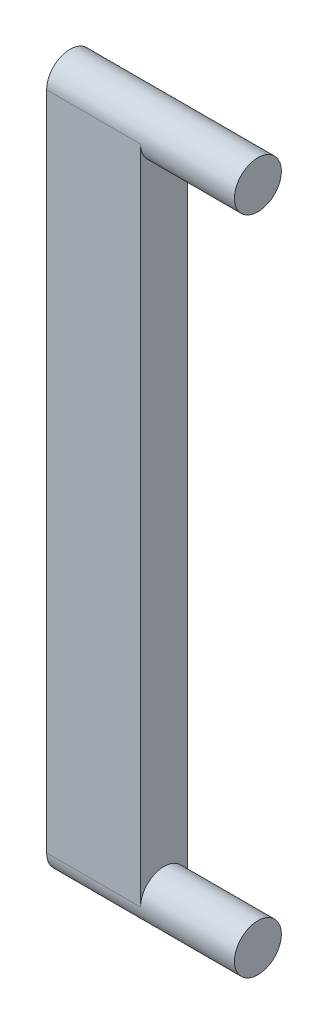
ISO-10303-21;
HEADER;
FILE_DESCRIPTION(('STEP AP214'),'2;1');
FILE_NAME('part.step','',(''),(''),'','','');
FILE_SCHEMA(('AUTOMOTIVE_DESIGN { 1 0 10303 214 1 1 1 1 }'));
ENDSEC;
DATA;
#1=APPLICATION_CONTEXT('core data for automotive mechanical design processes');
#2=APPLICATION_PROTOCOL_DEFINITION('international standard','automotive_design',2000,#1);
#3=PRODUCT_CONTEXT('',#1,'mechanical');
#4=PRODUCT('Part','Part','',(#3));
#5=PRODUCT_RELATED_PRODUCT_CATEGORY('part','',(#4));
#6=PRODUCT_DEFINITION_FORMATION('','',#4);
#7=PRODUCT_DEFINITION_CONTEXT('part definition',#1,'design');
#8=PRODUCT_DEFINITION('design','',#6,#7);
#9=PRODUCT_DEFINITION_SHAPE('','',#8);
#10=(LENGTH_UNIT() NAMED_UNIT(*) SI_UNIT(.MILLI.,.METRE.));
#11=(NAMED_UNIT(*) PLANE_ANGLE_UNIT() SI_UNIT($,.RADIAN.));
#12=(NAMED_UNIT(*) SI_UNIT($,.STERADIAN.) SOLID_ANGLE_UNIT());
#13=UNCERTAINTY_MEASURE_WITH_UNIT(LENGTH_MEASURE(1.E-05),#10,'distance_accuracy_value','');
#14=(GEOMETRIC_REPRESENTATION_CONTEXT(3) GLOBAL_UNCERTAINTY_ASSIGNED_CONTEXT((#13)) GLOBAL_UNIT_ASSIGNED_CONTEXT((#10,
#11,#12)) REPRESENTATION_CONTEXT('',''));
#15=CARTESIAN_POINT('',(0.,0.,0.));
#16=DIRECTION('',(0.,0.,1.));
#17=DIRECTION('',(1.,0.,0.));
#18=AXIS2_PLACEMENT_3D('',#15,#16,#17);
#19=CARTESIAN_POINT('',(-10.,0.,0.));
#20=DIRECTION('',(1.,0.,0.));
#21=DIRECTION('',(0.,0.,-1.));
#22=AXIS2_PLACEMENT_3D('',#19,#20,#21);
#23=CYLINDRICAL_SURFACE('',#22,2.5);
#24=CARTESIAN_POINT('',(-10.,0.,0.));
#25=DIRECTION('',(1.,0.,0.));
#26=DIRECTION('',(0.,0.,-1.));
#27=AXIS2_PLACEMENT_3D('',#24,#25,#26);
#28=CIRCLE('',#27,2.5);
#29=CARTESIAN_POINT('',(-10.,0.,2.5));
#30=VERTEX_POINT('',#29);
#31=CARTESIAN_POINT('',(-10.,0.,-2.5));
#32=VERTEX_POINT('',#31);
#33=EDGE_CURVE('E11',#30,#32,#28,.T.);
#34=ORIENTED_EDGE('',*,*,#33,.T.);
#35=DIRECTION('',(1.,0.,0.));
#36=VECTOR('',#35,1.);
#37=CARTESIAN_POINT('',(-20.,0.,-2.5));
#38=LINE('',#37,#36);
#39=CARTESIAN_POINT('',(-20.,0.,-2.5));
#40=VERTEX_POINT('',#39);
#41=EDGE_CURVE('E47',#40,#32,#38,.T.);
#42=ORIENTED_EDGE('',*,*,#41,.F.);
#43=CARTESIAN_POINT('',(-20.,0.,0.));
#44=DIRECTION('',(-1.,0.,0.));
#45=DIRECTION('',(0.,0.,1.));
#46=AXIS2_PLACEMENT_3D('',#43,#44,#45);
#47=CIRCLE('',#46,2.5);
#48=CARTESIAN_POINT('',(-20.,0.,2.5));
#49=VERTEX_POINT('',#48);
#50=EDGE_CURVE('E83',#49,#40,#47,.T.);
#51=ORIENTED_EDGE('',*,*,#50,.F.);
#52=DIRECTION('',(1.,0.,0.));
#53=VECTOR('',#52,1.);
#54=CARTESIAN_POINT('',(-20.,0.,2.5));
#55=LINE('',#54,#53);
#56=EDGE_CURVE('E92',#49,#30,#55,.T.);
#57=ORIENTED_EDGE('',*,*,#56,.T.);
#58=EDGE_LOOP('',(#34,#42,#51,#57));
#59=FACE_BOUND('',#58,.T.);
#60=CARTESIAN_POINT('',(0.,0.,0.));
#61=DIRECTION('',(1.,0.,0.));
#62=DIRECTION('',(0.,0.,-1.));
#63=AXIS2_PLACEMENT_3D('',#60,#61,#62);
#64=CIRCLE('',#63,2.5);
#65=CARTESIAN_POINT('',(0.,0.,-2.5));
#66=VERTEX_POINT('',#65);
#67=EDGE_CURVE('E36',#66,#66,#64,.T.);
#68=ORIENTED_EDGE('',*,*,#67,.F.);
#69=EDGE_LOOP('',(#68));
#70=FACE_BOUND('',#69,.T.);
#71=ADVANCED_FACE('F33',(#59,#70),#23,.T.);
#72=CARTESIAN_POINT('',(0.,0.,0.));
#73=DIRECTION('',(1.,0.,0.));
#74=DIRECTION('',(0.,0.,-1.));
#75=AXIS2_PLACEMENT_3D('',#72,#73,#74);
#76=PLANE('',#75);
#77=ORIENTED_EDGE('',*,*,#67,.T.);
#78=EDGE_LOOP('',(#77));
#79=FACE_BOUND('',#78,.T.);
#80=ADVANCED_FACE('F113',(#79),#76,.T.);
#81=CARTESIAN_POINT('',(-20.,0.,-2.5));
#82=DIRECTION('',(0.,0.,1.));
#83=DIRECTION('',(0.,-1.,0.));
#84=AXIS2_PLACEMENT_3D('',#81,#82,#83);
#85=PLANE('',#84);
#86=DIRECTION('',(0.,-1.,0.));
#87=VECTOR('',#86,1.);
#88=CARTESIAN_POINT('',(-10.,0.,-2.5));
#89=LINE('',#88,#87);
#90=CARTESIAN_POINT('',(-10.,-70.37,-2.5));
#91=VERTEX_POINT('',#90);
#92=EDGE_CURVE('E84',#32,#91,#89,.T.);
#93=ORIENTED_EDGE('',*,*,#92,.T.);
#94=DIRECTION('',(1.,0.,0.));
#95=VECTOR('',#94,1.);
#96=CARTESIAN_POINT('',(-20.,-70.37,-2.5));
#97=LINE('',#96,#95);
#98=CARTESIAN_POINT('',(-20.,-70.37,-2.5));
#99=VERTEX_POINT('',#98);
#100=EDGE_CURVE('E91',#99,#91,#97,.T.);
#101=ORIENTED_EDGE('',*,*,#100,.F.);
#102=DIRECTION('',(0.,-1.,0.));
#103=VECTOR('',#102,1.);
#104=CARTESIAN_POINT('',(-20.,0.,-2.5));
#105=LINE('',#104,#103);
#106=EDGE_CURVE('E74',#40,#99,#105,.T.);
#107=ORIENTED_EDGE('',*,*,#106,.F.);
#108=ORIENTED_EDGE('',*,*,#41,.T.);
#109=EDGE_LOOP('',(#93,#101,#107,#108));
#110=FACE_BOUND('',#109,.T.);
#111=ADVANCED_FACE('F120',(#110),#85,.F.);
#112=CARTESIAN_POINT('',(-20.,-70.37,0.));
#113=DIRECTION('',(1.,0.,0.));
#114=DIRECTION('',(0.,0.,-1.));
#115=AXIS2_PLACEMENT_3D('',#112,#113,#114);
#116=CYLINDRICAL_SURFACE('',#115,2.5);
#117=ORIENTED_EDGE('',*,*,#100,.T.);
#118=CARTESIAN_POINT('',(-10.,-70.37,0.));
#119=DIRECTION('',(1.,0.,0.));
#120=DIRECTION('',(0.,0.,-1.));
#121=AXIS2_PLACEMENT_3D('',#118,#119,#120);
#122=CIRCLE('',#121,2.5);
#123=CARTESIAN_POINT('',(-10.,-70.37,2.50000000000001));
#124=VERTEX_POINT('',#123);
#125=EDGE_CURVE('E80',#91,#124,#122,.T.);
#126=ORIENTED_EDGE('',*,*,#125,.T.);
#127=DIRECTION('',(1.,0.,0.));
#128=VECTOR('',#127,1.);
#129=CARTESIAN_POINT('',(-20.,-70.37,2.50000000000001));
#130=LINE('',#129,#128);
#131=CARTESIAN_POINT('',(-20.,-70.37,2.50000000000001));
#132=VERTEX_POINT('',#131);
#133=EDGE_CURVE('E87',#132,#124,#130,.T.);
#134=ORIENTED_EDGE('',*,*,#133,.F.);
#135=CARTESIAN_POINT('',(-20.,-70.37,0.));
#136=DIRECTION('',(-1.,0.,0.));
#137=DIRECTION('',(0.,0.,1.));
#138=AXIS2_PLACEMENT_3D('',#135,#136,#137);
#139=CIRCLE('',#138,2.5);
#140=EDGE_CURVE('E104',#99,#132,#139,.T.);
#141=ORIENTED_EDGE('',*,*,#140,.F.);
#142=EDGE_LOOP('',(#117,#126,#134,#141));
#143=FACE_BOUND('',#142,.T.);
#144=CARTESIAN_POINT('',(0.,-70.37,0.));
#145=DIRECTION('',(1.,0.,0.));
#146=DIRECTION('',(0.,0.,-1.));
#147=AXIS2_PLACEMENT_3D('',#144,#145,#146);
#148=CIRCLE('',#147,2.5);
#149=CARTESIAN_POINT('',(0.,-70.37,-2.5));
#150=VERTEX_POINT('',#149);
#151=EDGE_CURVE('E97',#150,#150,#148,.T.);
#152=ORIENTED_EDGE('',*,*,#151,.F.);
#153=EDGE_LOOP('',(#152));
#154=FACE_BOUND('',#153,.T.);
#155=ADVANCED_FACE('F95',(#143,#154),#116,.T.);
#156=CARTESIAN_POINT('',(-20.,-70.37,2.50000000000001));
#157=DIRECTION('',(0.,0.,-1.));
#158=DIRECTION('',(0.,1.,0.));
#159=AXIS2_PLACEMENT_3D('',#156,#157,#158);
#160=PLANE('',#159);
#161=DIRECTION('',(0.,1.,0.));
#162=VECTOR('',#161,1.);
#163=CARTESIAN_POINT('',(-10.,-70.37,2.50000000000001));
#164=LINE('',#163,#162);
#165=EDGE_CURVE('E76',#124,#30,#164,.T.);
#166=ORIENTED_EDGE('',*,*,#165,.T.);
#167=ORIENTED_EDGE('',*,*,#56,.F.);
#168=DIRECTION('',(0.,1.,0.));
#169=VECTOR('',#168,1.);
#170=CARTESIAN_POINT('',(-20.,-70.37,2.50000000000001));
#171=LINE('',#170,#169);
#172=EDGE_CURVE('E56',#132,#49,#171,.T.);
#173=ORIENTED_EDGE('',*,*,#172,.F.);
#174=ORIENTED_EDGE('',*,*,#133,.T.);
#175=EDGE_LOOP('',(#166,#167,#173,#174));
#176=FACE_BOUND('',#175,.T.);
#177=ADVANCED_FACE('F88',(#176),#160,.F.);
#178=CARTESIAN_POINT('',(-20.,0.,0.));
#179=DIRECTION('',(-1.,0.,0.));
#180=DIRECTION('',(0.,0.,1.));
#181=AXIS2_PLACEMENT_3D('',#178,#179,#180);
#182=PLANE('',#181);
#183=ORIENTED_EDGE('',*,*,#50,.T.);
#184=ORIENTED_EDGE('',*,*,#106,.T.);
#185=ORIENTED_EDGE('',*,*,#140,.T.);
#186=ORIENTED_EDGE('',*,*,#172,.T.);
#187=EDGE_LOOP('',(#183,#184,#185,#186));
#188=FACE_BOUND('',#187,.T.);
#189=ADVANCED_FACE('F122',(#188),#182,.T.);
#190=CARTESIAN_POINT('',(-10.,0.,0.));
#191=DIRECTION('',(-1.,0.,0.));
#192=DIRECTION('',(0.,0.,1.));
#193=AXIS2_PLACEMENT_3D('',#190,#191,#192);
#194=PLANE('',#193);
#195=ORIENTED_EDGE('',*,*,#125,.F.);
#196=ORIENTED_EDGE('',*,*,#92,.F.);
#197=ORIENTED_EDGE('',*,*,#33,.F.);
#198=ORIENTED_EDGE('',*,*,#165,.F.);
#199=EDGE_LOOP('',(#195,#196,#197,#198));
#200=FACE_BOUND('',#199,.T.);
#201=ADVANCED_FACE('F78',(#200),#194,.F.);
#202=CARTESIAN_POINT('',(0.,-70.37,0.));
#203=DIRECTION('',(1.,0.,0.));
#204=DIRECTION('',(0.,0.,-1.));
#205=AXIS2_PLACEMENT_3D('',#202,#203,#204);
#206=PLANE('',#205);
#207=ORIENTED_EDGE('',*,*,#151,.T.);
#208=EDGE_LOOP('',(#207));
#209=FACE_BOUND('',#208,.T.);
#210=ADVANCED_FACE('F134',(#209),#206,.T.);
#211=CLOSED_SHELL('',(#71,#80,#111,#155,#177,#189,#201,#210));
#212=MANIFOLD_SOLID_BREP('B2',#211);
#213=ADVANCED_BREP_SHAPE_REPRESENTATION('',(#18,#212),#14);
#214=SHAPE_DEFINITION_REPRESENTATION(#9,#213);
ENDSEC;
END-ISO-10303-21;
